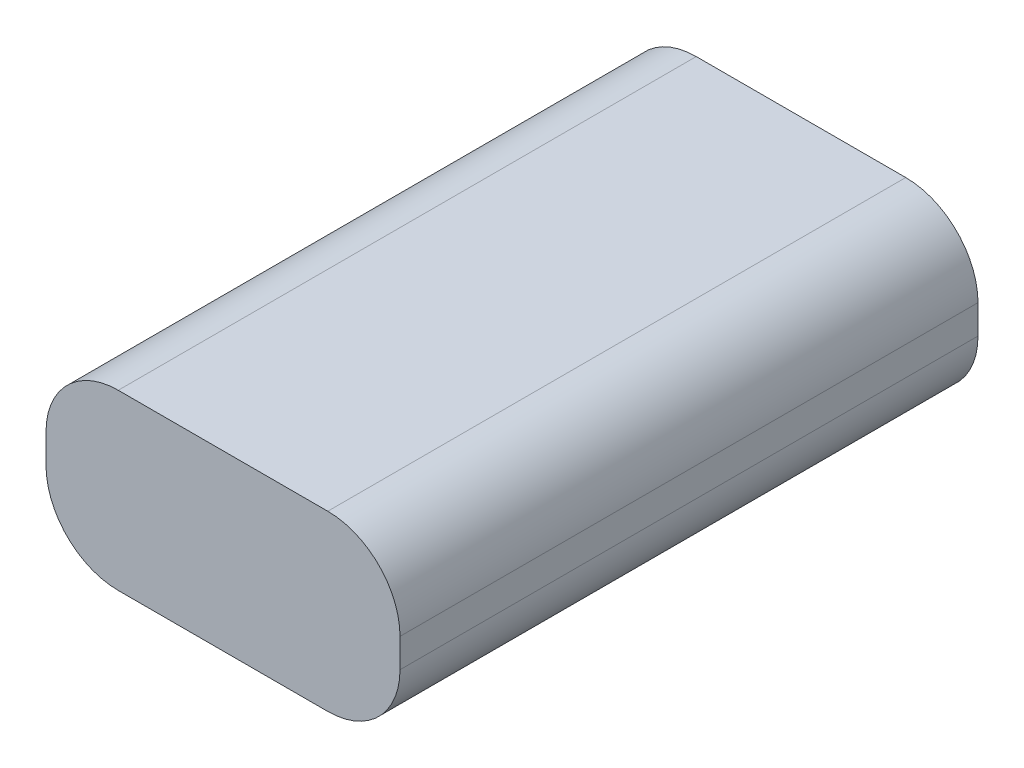
ISO-10303-21;
HEADER;
FILE_DESCRIPTION(('STEP AP214'),'2;1');
FILE_NAME('part.step','',(''),(''),'','','');
FILE_SCHEMA(('AUTOMOTIVE_DESIGN { 1 0 10303 214 1 1 1 1 }'));
ENDSEC;
DATA;
#1=APPLICATION_CONTEXT('core data for automotive mechanical design processes');
#2=APPLICATION_PROTOCOL_DEFINITION('international standard','automotive_design',2000,#1);
#3=PRODUCT_CONTEXT('',#1,'mechanical');
#4=PRODUCT('Part','Part','',(#3));
#5=PRODUCT_RELATED_PRODUCT_CATEGORY('part','',(#4));
#6=PRODUCT_DEFINITION_FORMATION('','',#4);
#7=PRODUCT_DEFINITION_CONTEXT('part definition',#1,'design');
#8=PRODUCT_DEFINITION('design','',#6,#7);
#9=PRODUCT_DEFINITION_SHAPE('','',#8);
#10=(LENGTH_UNIT() NAMED_UNIT(*) SI_UNIT(.MILLI.,.METRE.));
#11=(NAMED_UNIT(*) PLANE_ANGLE_UNIT() SI_UNIT($,.RADIAN.));
#12=(NAMED_UNIT(*) SI_UNIT($,.STERADIAN.) SOLID_ANGLE_UNIT());
#13=UNCERTAINTY_MEASURE_WITH_UNIT(LENGTH_MEASURE(1.E-05),#10,'distance_accuracy_value','');
#14=(GEOMETRIC_REPRESENTATION_CONTEXT(3) GLOBAL_UNCERTAINTY_ASSIGNED_CONTEXT((#13)) GLOBAL_UNIT_ASSIGNED_CONTEXT((#10,
#11,#12)) REPRESENTATION_CONTEXT('',''));
#15=CARTESIAN_POINT('',(0.,0.,0.));
#16=DIRECTION('',(0.,0.,1.));
#17=DIRECTION('',(1.,0.,0.));
#18=AXIS2_PLACEMENT_3D('',#15,#16,#17);
#19=CARTESIAN_POINT('',(0.,0.,80.));
#20=DIRECTION('',(1.,0.,0.));
#21=DIRECTION('',(0.,0.,-1.));
#22=AXIS2_PLACEMENT_3D('',#19,#20,#21);
#23=PLANE('',#22);
#24=DIRECTION('',(0.,-1.,0.));
#25=VECTOR('',#24,1.);
#26=CARTESIAN_POINT('',(0.,0.,0.));
#27=LINE('',#26,#25);
#28=CARTESIAN_POINT('',(0.,14.,0.));
#29=VERTEX_POINT('',#28);
#30=CARTESIAN_POINT('',(0.,10.,0.));
#31=VERTEX_POINT('',#30);
#32=EDGE_CURVE('E138',#29,#31,#27,.T.);
#33=ORIENTED_EDGE('',*,*,#32,.T.);
#34=DIRECTION('',(0.,0.,-1.));
#35=VECTOR('',#34,1.);
#36=CARTESIAN_POINT('',(0.,10.,80.));
#37=LINE('',#36,#35);
#38=CARTESIAN_POINT('',(0.,10.,80.));
#39=VERTEX_POINT('',#38);
#40=EDGE_CURVE('E112',#31,#39,#37,.F.);
#41=ORIENTED_EDGE('',*,*,#40,.T.);
#42=DIRECTION('',(0.,-1.,0.));
#43=VECTOR('',#42,1.);
#44=CARTESIAN_POINT('',(0.,0.,80.));
#45=LINE('',#44,#43);
#46=CARTESIAN_POINT('',(0.,14.,80.));
#47=VERTEX_POINT('',#46);
#48=EDGE_CURVE('E150',#47,#39,#45,.T.);
#49=ORIENTED_EDGE('',*,*,#48,.F.);
#50=DIRECTION('',(0.,0.,-1.));
#51=VECTOR('',#50,1.);
#52=CARTESIAN_POINT('',(0.,14.,80.));
#53=LINE('',#52,#51);
#54=EDGE_CURVE('E118',#47,#29,#53,.T.);
#55=ORIENTED_EDGE('',*,*,#54,.T.);
#56=EDGE_LOOP('',(#33,#41,#49,#55));
#57=FACE_BOUND('',#56,.T.);
#58=ADVANCED_FACE('F39',(#57),#23,.F.);
#59=CARTESIAN_POINT('',(0.,0.,80.));
#60=DIRECTION('',(0.,1.,0.));
#61=DIRECTION('',(0.,0.,1.));
#62=AXIS2_PLACEMENT_3D('',#59,#60,#61);
#63=PLANE('',#62);
#64=DIRECTION('',(1.,0.,0.));
#65=VECTOR('',#64,1.);
#66=CARTESIAN_POINT('',(0.,0.,80.));
#67=LINE('',#66,#65);
#68=CARTESIAN_POINT('',(10.,0.,80.));
#69=VERTEX_POINT('',#68);
#70=CARTESIAN_POINT('',(39.,0.,80.));
#71=VERTEX_POINT('',#70);
#72=EDGE_CURVE('E128',#69,#71,#67,.T.);
#73=ORIENTED_EDGE('',*,*,#72,.F.);
#74=DIRECTION('',(0.,0.,-1.));
#75=VECTOR('',#74,1.);
#76=CARTESIAN_POINT('',(10.,0.,80.));
#77=LINE('',#76,#75);
#78=CARTESIAN_POINT('',(10.,0.,0.));
#79=VERTEX_POINT('',#78);
#80=EDGE_CURVE('E111',#69,#79,#77,.T.);
#81=ORIENTED_EDGE('',*,*,#80,.T.);
#82=DIRECTION('',(1.,0.,0.));
#83=VECTOR('',#82,1.);
#84=CARTESIAN_POINT('',(0.,0.,0.));
#85=LINE('',#84,#83);
#86=CARTESIAN_POINT('',(39.,0.,0.));
#87=VERTEX_POINT('',#86);
#88=EDGE_CURVE('E125',#79,#87,#85,.T.);
#89=ORIENTED_EDGE('',*,*,#88,.T.);
#90=DIRECTION('',(0.,0.,-1.));
#91=VECTOR('',#90,1.);
#92=CARTESIAN_POINT('',(39.,0.,80.));
#93=LINE('',#92,#91);
#94=EDGE_CURVE('E131',#87,#71,#93,.F.);
#95=ORIENTED_EDGE('',*,*,#94,.T.);
#96=EDGE_LOOP('',(#73,#81,#89,#95));
#97=FACE_BOUND('',#96,.T.);
#98=ADVANCED_FACE('F124',(#97),#63,.F.);
#99=CARTESIAN_POINT('',(49.,0.,80.));
#100=DIRECTION('',(-1.,0.,0.));
#101=DIRECTION('',(0.,0.,1.));
#102=AXIS2_PLACEMENT_3D('',#99,#100,#101);
#103=PLANE('',#102);
#104=DIRECTION('',(0.,1.,0.));
#105=VECTOR('',#104,1.);
#106=CARTESIAN_POINT('',(49.,0.,80.));
#107=LINE('',#106,#105);
#108=CARTESIAN_POINT('',(49.,10.,80.));
#109=VERTEX_POINT('',#108);
#110=CARTESIAN_POINT('',(49.,14.,80.));
#111=VERTEX_POINT('',#110);
#112=EDGE_CURVE('E186',#109,#111,#107,.T.);
#113=ORIENTED_EDGE('',*,*,#112,.F.);
#114=DIRECTION('',(0.,0.,-1.));
#115=VECTOR('',#114,1.);
#116=CARTESIAN_POINT('',(49.,10.,80.));
#117=LINE('',#116,#115);
#118=CARTESIAN_POINT('',(49.,10.,0.));
#119=VERTEX_POINT('',#118);
#120=EDGE_CURVE('E11',#109,#119,#117,.T.);
#121=ORIENTED_EDGE('',*,*,#120,.T.);
#122=DIRECTION('',(0.,1.,0.));
#123=VECTOR('',#122,1.);
#124=CARTESIAN_POINT('',(49.,0.,0.));
#125=LINE('',#124,#123);
#126=CARTESIAN_POINT('',(49.,14.,0.));
#127=VERTEX_POINT('',#126);
#128=EDGE_CURVE('E137',#119,#127,#125,.T.);
#129=ORIENTED_EDGE('',*,*,#128,.T.);
#130=DIRECTION('',(0.,0.,-1.));
#131=VECTOR('',#130,1.);
#132=CARTESIAN_POINT('',(49.,14.,80.));
#133=LINE('',#132,#131);
#134=EDGE_CURVE('E48',#127,#111,#133,.F.);
#135=ORIENTED_EDGE('',*,*,#134,.T.);
#136=EDGE_LOOP('',(#113,#121,#129,#135));
#137=FACE_BOUND('',#136,.T.);
#138=ADVANCED_FACE('F185',(#137),#103,.F.);
#139=CARTESIAN_POINT('',(0.,24.,80.));
#140=DIRECTION('',(0.,-1.,0.));
#141=DIRECTION('',(0.,0.,-1.));
#142=AXIS2_PLACEMENT_3D('',#139,#140,#141);
#143=PLANE('',#142);
#144=DIRECTION('',(-1.,0.,0.));
#145=VECTOR('',#144,1.);
#146=CARTESIAN_POINT('',(0.,24.,0.));
#147=LINE('',#146,#145);
#148=CARTESIAN_POINT('',(39.,24.,0.));
#149=VERTEX_POINT('',#148);
#150=CARTESIAN_POINT('',(10.,24.,0.));
#151=VERTEX_POINT('',#150);
#152=EDGE_CURVE('E143',#149,#151,#147,.T.);
#153=ORIENTED_EDGE('',*,*,#152,.T.);
#154=DIRECTION('',(0.,0.,-1.));
#155=VECTOR('',#154,1.);
#156=CARTESIAN_POINT('',(10.,24.,80.));
#157=LINE('',#156,#155);
#158=CARTESIAN_POINT('',(10.,24.,80.));
#159=VERTEX_POINT('',#158);
#160=EDGE_CURVE('E55',#151,#159,#157,.F.);
#161=ORIENTED_EDGE('',*,*,#160,.T.);
#162=DIRECTION('',(-1.,0.,0.));
#163=VECTOR('',#162,1.);
#164=CARTESIAN_POINT('',(0.,24.,80.));
#165=LINE('',#164,#163);
#166=CARTESIAN_POINT('',(39.,24.,80.));
#167=VERTEX_POINT('',#166);
#168=EDGE_CURVE('E152',#167,#159,#165,.T.);
#169=ORIENTED_EDGE('',*,*,#168,.F.);
#170=DIRECTION('',(0.,0.,-1.));
#171=VECTOR('',#170,1.);
#172=CARTESIAN_POINT('',(39.,24.,80.));
#173=LINE('',#172,#171);
#174=EDGE_CURVE('E176',#167,#149,#173,.T.);
#175=ORIENTED_EDGE('',*,*,#174,.T.);
#176=EDGE_LOOP('',(#153,#161,#169,#175));
#177=FACE_BOUND('',#176,.T.);
#178=ADVANCED_FACE('F196',(#177),#143,.F.);
#179=CARTESIAN_POINT('',(0.,0.,80.));
#180=DIRECTION('',(0.,0.,-1.));
#181=DIRECTION('',(-1.,0.,0.));
#182=AXIS2_PLACEMENT_3D('',#179,#180,#181);
#183=PLANE('',#182);
#184=ORIENTED_EDGE('',*,*,#48,.T.);
#185=CARTESIAN_POINT('',(10.,10.,80.));
#186=DIRECTION('',(0.,0.,-1.));
#187=DIRECTION('',(-1.,0.,0.));
#188=AXIS2_PLACEMENT_3D('',#185,#186,#187);
#189=CIRCLE('',#188,10.);
#190=EDGE_CURVE('E173',#39,#69,#189,.F.);
#191=ORIENTED_EDGE('',*,*,#190,.T.);
#192=ORIENTED_EDGE('',*,*,#72,.T.);
#193=CARTESIAN_POINT('',(39.,10.,80.));
#194=DIRECTION('',(0.,0.,-1.));
#195=DIRECTION('',(-1.,0.,0.));
#196=AXIS2_PLACEMENT_3D('',#193,#194,#195);
#197=CIRCLE('',#196,10.);
#198=EDGE_CURVE('E167',#71,#109,#197,.F.);
#199=ORIENTED_EDGE('',*,*,#198,.T.);
#200=ORIENTED_EDGE('',*,*,#112,.T.);
#201=CARTESIAN_POINT('',(39.,14.,80.));
#202=DIRECTION('',(0.,0.,-1.));
#203=DIRECTION('',(-1.,0.,0.));
#204=AXIS2_PLACEMENT_3D('',#201,#202,#203);
#205=CIRCLE('',#204,10.);
#206=EDGE_CURVE('E62',#111,#167,#205,.F.);
#207=ORIENTED_EDGE('',*,*,#206,.T.);
#208=ORIENTED_EDGE('',*,*,#168,.T.);
#209=CARTESIAN_POINT('',(10.,14.,80.));
#210=DIRECTION('',(0.,0.,-1.));
#211=DIRECTION('',(-1.,0.,0.));
#212=AXIS2_PLACEMENT_3D('',#209,#210,#211);
#213=CIRCLE('',#212,10.);
#214=EDGE_CURVE('E170',#159,#47,#213,.F.);
#215=ORIENTED_EDGE('',*,*,#214,.T.);
#216=EDGE_LOOP('',(#184,#191,#192,#199,#200,#207,#208,#215));
#217=FACE_BOUND('',#216,.T.);
#218=ADVANCED_FACE('F190',(#217),#183,.F.);
#219=CARTESIAN_POINT('',(0.,0.,0.));
#220=DIRECTION('',(0.,0.,-1.));
#221=DIRECTION('',(-1.,0.,0.));
#222=AXIS2_PLACEMENT_3D('',#219,#220,#221);
#223=PLANE('',#222);
#224=ORIENTED_EDGE('',*,*,#88,.F.);
#225=CARTESIAN_POINT('',(10.,10.,0.));
#226=DIRECTION('',(0.,0.,-1.));
#227=DIRECTION('',(-1.,0.,0.));
#228=AXIS2_PLACEMENT_3D('',#225,#226,#227);
#229=CIRCLE('',#228,10.);
#230=EDGE_CURVE('E107',#79,#31,#229,.T.);
#231=ORIENTED_EDGE('',*,*,#230,.T.);
#232=ORIENTED_EDGE('',*,*,#32,.F.);
#233=CARTESIAN_POINT('',(10.,14.,0.));
#234=DIRECTION('',(0.,0.,-1.));
#235=DIRECTION('',(-1.,0.,0.));
#236=AXIS2_PLACEMENT_3D('',#233,#234,#235);
#237=CIRCLE('',#236,10.);
#238=EDGE_CURVE('E119',#29,#151,#237,.T.);
#239=ORIENTED_EDGE('',*,*,#238,.T.);
#240=ORIENTED_EDGE('',*,*,#152,.F.);
#241=CARTESIAN_POINT('',(39.,14.,0.));
#242=DIRECTION('',(0.,0.,-1.));
#243=DIRECTION('',(-1.,0.,0.));
#244=AXIS2_PLACEMENT_3D('',#241,#242,#243);
#245=CIRCLE('',#244,10.);
#246=EDGE_CURVE('E130',#149,#127,#245,.T.);
#247=ORIENTED_EDGE('',*,*,#246,.T.);
#248=ORIENTED_EDGE('',*,*,#128,.F.);
#249=CARTESIAN_POINT('',(39.,10.,0.));
#250=DIRECTION('',(0.,0.,-1.));
#251=DIRECTION('',(-1.,0.,0.));
#252=AXIS2_PLACEMENT_3D('',#249,#250,#251);
#253=CIRCLE('',#252,10.);
#254=EDGE_CURVE('E135',#119,#87,#253,.T.);
#255=ORIENTED_EDGE('',*,*,#254,.T.);
#256=EDGE_LOOP('',(#224,#231,#232,#239,#240,#247,#248,#255));
#257=FACE_BOUND('',#256,.T.);
#258=ADVANCED_FACE('F133',(#257),#223,.T.);
#259=CARTESIAN_POINT('',(10.,10.,80.));
#260=DIRECTION('',(0.,0.,-1.));
#261=DIRECTION('',(-1.,0.,0.));
#262=AXIS2_PLACEMENT_3D('',#259,#260,#261);
#263=CYLINDRICAL_SURFACE('',#262,10.);
#264=ORIENTED_EDGE('',*,*,#190,.F.);
#265=ORIENTED_EDGE('',*,*,#40,.F.);
#266=ORIENTED_EDGE('',*,*,#230,.F.);
#267=ORIENTED_EDGE('',*,*,#80,.F.);
#268=EDGE_LOOP('',(#264,#265,#266,#267));
#269=FACE_BOUND('',#268,.T.);
#270=ADVANCED_FACE('F110',(#269),#263,.T.);
#271=CARTESIAN_POINT('',(10.,14.,80.));
#272=DIRECTION('',(0.,0.,-1.));
#273=DIRECTION('',(-1.,0.,0.));
#274=AXIS2_PLACEMENT_3D('',#271,#272,#273);
#275=CYLINDRICAL_SURFACE('',#274,10.);
#276=ORIENTED_EDGE('',*,*,#214,.F.);
#277=ORIENTED_EDGE('',*,*,#160,.F.);
#278=ORIENTED_EDGE('',*,*,#238,.F.);
#279=ORIENTED_EDGE('',*,*,#54,.F.);
#280=EDGE_LOOP('',(#276,#277,#278,#279));
#281=FACE_BOUND('',#280,.T.);
#282=ADVANCED_FACE('F200',(#281),#275,.T.);
#283=CARTESIAN_POINT('',(39.,10.,80.));
#284=DIRECTION('',(0.,0.,-1.));
#285=DIRECTION('',(-1.,0.,0.));
#286=AXIS2_PLACEMENT_3D('',#283,#284,#285);
#287=CYLINDRICAL_SURFACE('',#286,10.);
#288=ORIENTED_EDGE('',*,*,#198,.F.);
#289=ORIENTED_EDGE('',*,*,#94,.F.);
#290=ORIENTED_EDGE('',*,*,#254,.F.);
#291=ORIENTED_EDGE('',*,*,#120,.F.);
#292=EDGE_LOOP('',(#288,#289,#290,#291));
#293=FACE_BOUND('',#292,.T.);
#294=ADVANCED_FACE('F209',(#293),#287,.T.);
#295=CARTESIAN_POINT('',(39.,14.,80.));
#296=DIRECTION('',(0.,0.,-1.));
#297=DIRECTION('',(-1.,0.,0.));
#298=AXIS2_PLACEMENT_3D('',#295,#296,#297);
#299=CYLINDRICAL_SURFACE('',#298,10.);
#300=ORIENTED_EDGE('',*,*,#206,.F.);
#301=ORIENTED_EDGE('',*,*,#134,.F.);
#302=ORIENTED_EDGE('',*,*,#246,.F.);
#303=ORIENTED_EDGE('',*,*,#174,.F.);
#304=EDGE_LOOP('',(#300,#301,#302,#303));
#305=FACE_BOUND('',#304,.T.);
#306=ADVANCED_FACE('F41',(#305),#299,.T.);
#307=CLOSED_SHELL('',(#58,#98,#138,#178,#218,#258,#270,#282,#294,#306));
#308=MANIFOLD_SOLID_BREP('B2',#307);
#309=ADVANCED_BREP_SHAPE_REPRESENTATION('',(#18,#308),#14);
#310=SHAPE_DEFINITION_REPRESENTATION(#9,#309);
ENDSEC;
END-ISO-10303-21;
